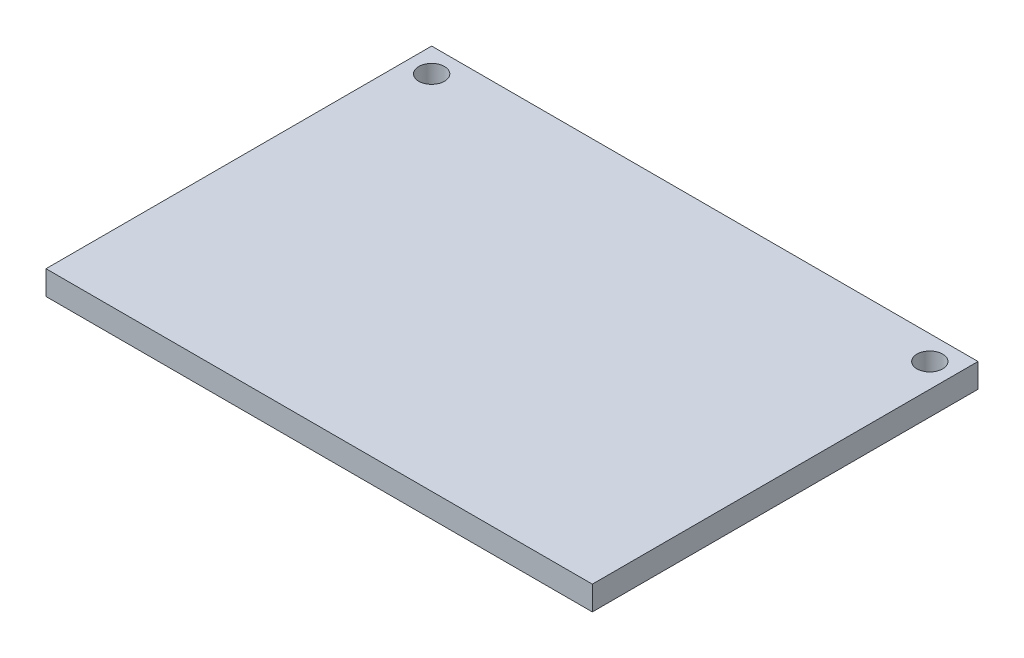
ISO-10303-21;
HEADER;
FILE_DESCRIPTION(('STEP AP214'),'2;1');
FILE_NAME('part.step','',(''),(''),'','','');
FILE_SCHEMA(('AUTOMOTIVE_DESIGN { 1 0 10303 214 1 1 1 1 }'));
ENDSEC;
DATA;
#1=APPLICATION_CONTEXT('core data for automotive mechanical design processes');
#2=APPLICATION_PROTOCOL_DEFINITION('international standard','automotive_design',2000,#1);
#3=PRODUCT_CONTEXT('',#1,'mechanical');
#4=PRODUCT('Part','Part','',(#3));
#5=PRODUCT_RELATED_PRODUCT_CATEGORY('part','',(#4));
#6=PRODUCT_DEFINITION_FORMATION('','',#4);
#7=PRODUCT_DEFINITION_CONTEXT('part definition',#1,'design');
#8=PRODUCT_DEFINITION('design','',#6,#7);
#9=PRODUCT_DEFINITION_SHAPE('','',#8);
#10=(LENGTH_UNIT() NAMED_UNIT(*) SI_UNIT(.MILLI.,.METRE.));
#11=(NAMED_UNIT(*) PLANE_ANGLE_UNIT() SI_UNIT($,.RADIAN.));
#12=(NAMED_UNIT(*) SI_UNIT($,.STERADIAN.) SOLID_ANGLE_UNIT());
#13=UNCERTAINTY_MEASURE_WITH_UNIT(LENGTH_MEASURE(1.E-05),#10,'distance_accuracy_value','');
#14=(GEOMETRIC_REPRESENTATION_CONTEXT(3) GLOBAL_UNCERTAINTY_ASSIGNED_CONTEXT((#13)) GLOBAL_UNIT_ASSIGNED_CONTEXT((#10,
#11,#12)) REPRESENTATION_CONTEXT('',''));
#15=CARTESIAN_POINT('',(0.,0.,0.));
#16=DIRECTION('',(0.,0.,1.));
#17=DIRECTION('',(1.,0.,0.));
#18=AXIS2_PLACEMENT_3D('',#15,#16,#17);
#19=CARTESIAN_POINT('',(0.,3.,0.));
#20=DIRECTION('',(0.,-1.,0.));
#21=DIRECTION('',(0.,0.,-1.));
#22=AXIS2_PLACEMENT_3D('',#19,#20,#21);
#23=PLANE('',#22);
#24=DIRECTION('',(0.,0.,-1.));
#25=VECTOR('',#24,1.);
#26=CARTESIAN_POINT('',(-43.7957317073171,3.,-25.4649390243902));
#27=LINE('',#26,#25);
#28=CARTESIAN_POINT('',(-43.7957317073171,3.,22.5350609756098));
#29=VERTEX_POINT('',#28);
#30=CARTESIAN_POINT('',(-43.7957317073171,3.,-25.4649390243902));
#31=VERTEX_POINT('',#30);
#32=EDGE_CURVE('E85',#29,#31,#27,.T.);
#33=ORIENTED_EDGE('',*,*,#32,.T.);
#34=DIRECTION('',(-1.,0.,0.));
#35=VECTOR('',#34,1.);
#36=CARTESIAN_POINT('',(-43.7957317073171,3.,-25.4649390243902));
#37=LINE('',#36,#35);
#38=CARTESIAN_POINT('',(-111.795731707317,3.,-25.4649390243902));
#39=VERTEX_POINT('',#38);
#40=EDGE_CURVE('E80',#31,#39,#37,.T.);
#41=ORIENTED_EDGE('',*,*,#40,.T.);
#42=DIRECTION('',(0.,0.,1.));
#43=VECTOR('',#42,1.);
#44=CARTESIAN_POINT('',(-111.795731707317,3.,-25.4649390243902));
#45=LINE('',#44,#43);
#46=CARTESIAN_POINT('',(-111.795731707317,3.,22.5350609756098));
#47=VERTEX_POINT('',#46);
#48=EDGE_CURVE('E83',#39,#47,#45,.T.);
#49=ORIENTED_EDGE('',*,*,#48,.T.);
#50=DIRECTION('',(1.,0.,0.));
#51=VECTOR('',#50,1.);
#52=CARTESIAN_POINT('',(-43.7957317073171,3.,22.5350609756098));
#53=LINE('',#52,#51);
#54=EDGE_CURVE('E50',#47,#29,#53,.T.);
#55=ORIENTED_EDGE('',*,*,#54,.T.);
#56=EDGE_LOOP('',(#33,#41,#49,#55));
#57=FACE_BOUND('',#56,.T.);
#58=CARTESIAN_POINT('',(-108.795731707317,3.,-22.4649390243902));
#59=DIRECTION('',(0.,1.,0.));
#60=DIRECTION('',(0.,0.,1.));
#61=AXIS2_PLACEMENT_3D('',#58,#59,#60);
#62=CIRCLE('',#61,1.6);
#63=CARTESIAN_POINT('',(-108.795731707317,3.,-20.8649390243902));
#64=VERTEX_POINT('',#63);
#65=EDGE_CURVE('E100',#64,#64,#62,.T.);
#66=ORIENTED_EDGE('',*,*,#65,.F.);
#67=EDGE_LOOP('',(#66));
#68=FACE_BOUND('',#67,.T.);
#69=CARTESIAN_POINT('',(-46.7957317073171,3.,-22.4649390243902));
#70=DIRECTION('',(0.,1.,0.));
#71=DIRECTION('',(0.,0.,1.));
#72=AXIS2_PLACEMENT_3D('',#69,#70,#71);
#73=CIRCLE('',#72,1.6);
#74=CARTESIAN_POINT('',(-46.7957317073171,3.,-20.8649390243902));
#75=VERTEX_POINT('',#74);
#76=EDGE_CURVE('E115',#75,#75,#73,.T.);
#77=ORIENTED_EDGE('',*,*,#76,.F.);
#78=EDGE_LOOP('',(#77));
#79=FACE_BOUND('',#78,.T.);
#80=ADVANCED_FACE('F33',(#57,#68,#79),#23,.F.);
#81=CARTESIAN_POINT('',(0.,0.,0.));
#82=DIRECTION('',(0.,-1.,0.));
#83=DIRECTION('',(0.,0.,-1.));
#84=AXIS2_PLACEMENT_3D('',#81,#82,#83);
#85=PLANE('',#84);
#86=CARTESIAN_POINT('',(-108.795731707317,0.,-22.4649390243902));
#87=DIRECTION('',(0.,1.,0.));
#88=DIRECTION('',(0.,0.,1.));
#89=AXIS2_PLACEMENT_3D('',#86,#87,#88);
#90=CIRCLE('',#89,1.6);
#91=CARTESIAN_POINT('',(-108.795731707317,0.,-20.8649390243902));
#92=VERTEX_POINT('',#91);
#93=EDGE_CURVE('E112',#92,#92,#90,.T.);
#94=ORIENTED_EDGE('',*,*,#93,.T.);
#95=EDGE_LOOP('',(#94));
#96=FACE_BOUND('',#95,.T.);
#97=DIRECTION('',(0.,0.,-1.));
#98=VECTOR('',#97,1.);
#99=CARTESIAN_POINT('',(-43.7957317073171,0.,-25.4649390243902));
#100=LINE('',#99,#98);
#101=CARTESIAN_POINT('',(-43.7957317073171,0.,22.5350609756098));
#102=VERTEX_POINT('',#101);
#103=CARTESIAN_POINT('',(-43.7957317073171,0.,-25.4649390243902));
#104=VERTEX_POINT('',#103);
#105=EDGE_CURVE('E97',#102,#104,#100,.T.);
#106=ORIENTED_EDGE('',*,*,#105,.F.);
#107=DIRECTION('',(1.,0.,0.));
#108=VECTOR('',#107,1.);
#109=CARTESIAN_POINT('',(-43.7957317073171,0.,22.5350609756098));
#110=LINE('',#109,#108);
#111=CARTESIAN_POINT('',(-111.795731707317,0.,22.5350609756098));
#112=VERTEX_POINT('',#111);
#113=EDGE_CURVE('E73',#112,#102,#110,.T.);
#114=ORIENTED_EDGE('',*,*,#113,.F.);
#115=DIRECTION('',(0.,0.,1.));
#116=VECTOR('',#115,1.);
#117=CARTESIAN_POINT('',(-111.795731707317,0.,-25.4649390243902));
#118=LINE('',#117,#116);
#119=CARTESIAN_POINT('',(-111.795731707317,0.,-25.4649390243902));
#120=VERTEX_POINT('',#119);
#121=EDGE_CURVE('E67',#120,#112,#118,.T.);
#122=ORIENTED_EDGE('',*,*,#121,.F.);
#123=DIRECTION('',(-1.,0.,0.));
#124=VECTOR('',#123,1.);
#125=CARTESIAN_POINT('',(-43.7957317073171,0.,-25.4649390243902));
#126=LINE('',#125,#124);
#127=EDGE_CURVE('E89',#104,#120,#126,.T.);
#128=ORIENTED_EDGE('',*,*,#127,.F.);
#129=EDGE_LOOP('',(#106,#114,#122,#128));
#130=FACE_BOUND('',#129,.T.);
#131=CARTESIAN_POINT('',(-46.7957317073171,0.,-22.4649390243902));
#132=DIRECTION('',(0.,1.,0.));
#133=DIRECTION('',(0.,0.,1.));
#134=AXIS2_PLACEMENT_3D('',#131,#132,#133);
#135=CIRCLE('',#134,1.6);
#136=CARTESIAN_POINT('',(-46.7957317073171,0.,-20.8649390243902));
#137=VERTEX_POINT('',#136);
#138=EDGE_CURVE('E118',#137,#137,#135,.T.);
#139=ORIENTED_EDGE('',*,*,#138,.T.);
#140=EDGE_LOOP('',(#139));
#141=FACE_BOUND('',#140,.T.);
#142=ADVANCED_FACE('F108',(#96,#130,#141),#85,.T.);
#143=CARTESIAN_POINT('',(-43.7957317073171,3.,-25.4649390243902));
#144=DIRECTION('',(-1.,0.,0.));
#145=DIRECTION('',(0.,0.,1.));
#146=AXIS2_PLACEMENT_3D('',#143,#144,#145);
#147=PLANE('',#146);
#148=ORIENTED_EDGE('',*,*,#105,.T.);
#149=DIRECTION('',(0.,-1.,0.));
#150=VECTOR('',#149,1.);
#151=CARTESIAN_POINT('',(-43.7957317073171,3.,-25.4649390243902));
#152=LINE('',#151,#150);
#153=EDGE_CURVE('E11',#31,#104,#152,.T.);
#154=ORIENTED_EDGE('',*,*,#153,.F.);
#155=ORIENTED_EDGE('',*,*,#32,.F.);
#156=DIRECTION('',(0.,-1.,0.));
#157=VECTOR('',#156,1.);
#158=CARTESIAN_POINT('',(-43.7957317073171,3.,22.5350609756098));
#159=LINE('',#158,#157);
#160=EDGE_CURVE('E93',#29,#102,#159,.T.);
#161=ORIENTED_EDGE('',*,*,#160,.T.);
#162=EDGE_LOOP('',(#148,#154,#155,#161));
#163=FACE_BOUND('',#162,.T.);
#164=ADVANCED_FACE('F35',(#163),#147,.F.);
#165=CARTESIAN_POINT('',(-43.7957317073171,3.,-25.4649390243902));
#166=DIRECTION('',(0.,0.,1.));
#167=DIRECTION('',(1.,0.,0.));
#168=AXIS2_PLACEMENT_3D('',#165,#166,#167);
#169=PLANE('',#168);
#170=ORIENTED_EDGE('',*,*,#127,.T.);
#171=DIRECTION('',(0.,-1.,0.));
#172=VECTOR('',#171,1.);
#173=CARTESIAN_POINT('',(-111.795731707317,3.,-25.4649390243902));
#174=LINE('',#173,#172);
#175=EDGE_CURVE('E42',#39,#120,#174,.T.);
#176=ORIENTED_EDGE('',*,*,#175,.F.);
#177=ORIENTED_EDGE('',*,*,#40,.F.);
#178=ORIENTED_EDGE('',*,*,#153,.T.);
#179=EDGE_LOOP('',(#170,#176,#177,#178));
#180=FACE_BOUND('',#179,.T.);
#181=ADVANCED_FACE('F88',(#180),#169,.F.);
#182=CARTESIAN_POINT('',(-111.795731707317,3.,-25.4649390243902));
#183=DIRECTION('',(1.,0.,0.));
#184=DIRECTION('',(0.,0.,-1.));
#185=AXIS2_PLACEMENT_3D('',#182,#183,#184);
#186=PLANE('',#185);
#187=ORIENTED_EDGE('',*,*,#121,.T.);
#188=DIRECTION('',(0.,-1.,0.));
#189=VECTOR('',#188,1.);
#190=CARTESIAN_POINT('',(-111.795731707317,3.,22.5350609756098));
#191=LINE('',#190,#189);
#192=EDGE_CURVE('E90',#47,#112,#191,.T.);
#193=ORIENTED_EDGE('',*,*,#192,.F.);
#194=ORIENTED_EDGE('',*,*,#48,.F.);
#195=ORIENTED_EDGE('',*,*,#175,.T.);
#196=EDGE_LOOP('',(#187,#193,#194,#195));
#197=FACE_BOUND('',#196,.T.);
#198=ADVANCED_FACE('F91',(#197),#186,.F.);
#199=CARTESIAN_POINT('',(-43.7957317073171,3.,22.5350609756098));
#200=DIRECTION('',(0.,0.,-1.));
#201=DIRECTION('',(-1.,0.,0.));
#202=AXIS2_PLACEMENT_3D('',#199,#200,#201);
#203=PLANE('',#202);
#204=ORIENTED_EDGE('',*,*,#113,.T.);
#205=ORIENTED_EDGE('',*,*,#160,.F.);
#206=ORIENTED_EDGE('',*,*,#54,.F.);
#207=ORIENTED_EDGE('',*,*,#192,.T.);
#208=EDGE_LOOP('',(#204,#205,#206,#207));
#209=FACE_BOUND('',#208,.T.);
#210=ADVANCED_FACE('F105',(#209),#203,.F.);
#211=CARTESIAN_POINT('',(-108.795731707317,3.,-22.4649390243902));
#212=DIRECTION('',(0.,-1.,0.));
#213=DIRECTION('',(0.,0.,-1.));
#214=AXIS2_PLACEMENT_3D('',#211,#212,#213);
#215=CYLINDRICAL_SURFACE('',#214,1.6);
#216=ORIENTED_EDGE('',*,*,#65,.T.);
#217=EDGE_LOOP('',(#216));
#218=FACE_BOUND('',#217,.T.);
#219=ORIENTED_EDGE('',*,*,#93,.F.);
#220=EDGE_LOOP('',(#219));
#221=FACE_BOUND('',#220,.T.);
#222=ADVANCED_FACE('F135',(#218,#221),#215,.F.);
#223=CARTESIAN_POINT('',(-46.7957317073171,3.,-22.4649390243902));
#224=DIRECTION('',(0.,-1.,0.));
#225=DIRECTION('',(0.,0.,-1.));
#226=AXIS2_PLACEMENT_3D('',#223,#224,#225);
#227=CYLINDRICAL_SURFACE('',#226,1.6);
#228=ORIENTED_EDGE('',*,*,#76,.T.);
#229=EDGE_LOOP('',(#228));
#230=FACE_BOUND('',#229,.T.);
#231=ORIENTED_EDGE('',*,*,#138,.F.);
#232=EDGE_LOOP('',(#231));
#233=FACE_BOUND('',#232,.T.);
#234=ADVANCED_FACE('F124',(#230,#233),#227,.F.);
#235=CLOSED_SHELL('',(#80,#142,#164,#181,#198,#210,#222,#234));
#236=MANIFOLD_SOLID_BREP('B2',#235);
#237=ADVANCED_BREP_SHAPE_REPRESENTATION('',(#18,#236),#14);
#238=SHAPE_DEFINITION_REPRESENTATION(#9,#237);
ENDSEC;
END-ISO-10303-21;
